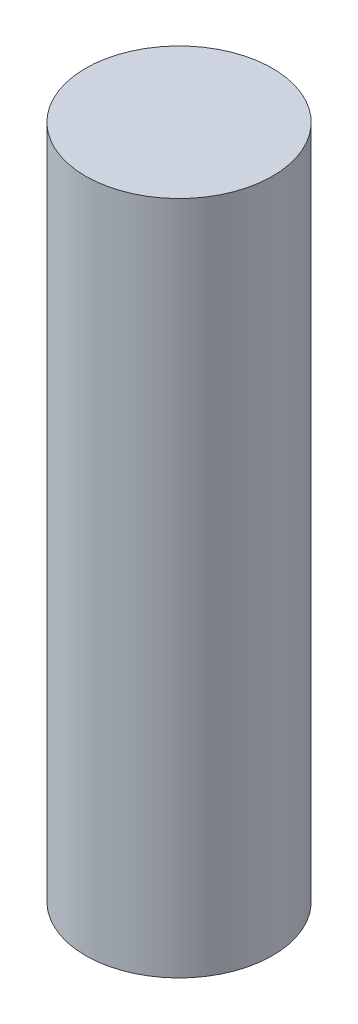
ISO-10303-21;
HEADER;
FILE_DESCRIPTION(('STEP AP214'),'2;1');
FILE_NAME('part.step','',(''),(''),'','','');
FILE_SCHEMA(('AUTOMOTIVE_DESIGN { 1 0 10303 214 1 1 1 1 }'));
ENDSEC;
DATA;
#1=APPLICATION_CONTEXT('core data for automotive mechanical design processes');
#2=APPLICATION_PROTOCOL_DEFINITION('international standard','automotive_design',2000,#1);
#3=PRODUCT_CONTEXT('',#1,'mechanical');
#4=PRODUCT('Part','Part','',(#3));
#5=PRODUCT_RELATED_PRODUCT_CATEGORY('part','',(#4));
#6=PRODUCT_DEFINITION_FORMATION('','',#4);
#7=PRODUCT_DEFINITION_CONTEXT('part definition',#1,'design');
#8=PRODUCT_DEFINITION('design','',#6,#7);
#9=PRODUCT_DEFINITION_SHAPE('','',#8);
#10=(LENGTH_UNIT() NAMED_UNIT(*) SI_UNIT(.MILLI.,.METRE.));
#11=(NAMED_UNIT(*) PLANE_ANGLE_UNIT() SI_UNIT($,.RADIAN.));
#12=(NAMED_UNIT(*) SI_UNIT($,.STERADIAN.) SOLID_ANGLE_UNIT());
#13=UNCERTAINTY_MEASURE_WITH_UNIT(LENGTH_MEASURE(1.E-05),#10,'distance_accuracy_value','');
#14=(GEOMETRIC_REPRESENTATION_CONTEXT(3) GLOBAL_UNCERTAINTY_ASSIGNED_CONTEXT((#13)) GLOBAL_UNIT_ASSIGNED_CONTEXT((#10,
#11,#12)) REPRESENTATION_CONTEXT('',''));
#15=CARTESIAN_POINT('',(0.,0.,0.));
#16=DIRECTION('',(0.,0.,1.));
#17=DIRECTION('',(1.,0.,0.));
#18=AXIS2_PLACEMENT_3D('',#15,#16,#17);
#19=CARTESIAN_POINT('',(0.,65.,0.));
#20=DIRECTION('',(0.,-1.,0.));
#21=DIRECTION('',(0.,0.,-1.));
#22=AXIS2_PLACEMENT_3D('',#19,#20,#21);
#23=CYLINDRICAL_SURFACE('',#22,9.);
#24=CARTESIAN_POINT('',(0.,65.,0.));
#25=DIRECTION('',(0.,1.,0.));
#26=DIRECTION('',(0.,0.,1.));
#27=AXIS2_PLACEMENT_3D('',#24,#25,#26);
#28=CIRCLE('',#27,9.);
#29=CARTESIAN_POINT('',(0.,65.,9.));
#30=VERTEX_POINT('',#29);
#31=EDGE_CURVE('E10',#30,#30,#28,.T.);
#32=ORIENTED_EDGE('',*,*,#31,.F.);
#33=EDGE_LOOP('',(#32));
#34=FACE_BOUND('',#33,.T.);
#35=CARTESIAN_POINT('',(0.,0.,0.));
#36=DIRECTION('',(0.,1.,0.));
#37=DIRECTION('',(0.,0.,1.));
#38=AXIS2_PLACEMENT_3D('',#35,#36,#37);
#39=CIRCLE('',#38,9.);
#40=CARTESIAN_POINT('',(0.,0.,9.));
#41=VERTEX_POINT('',#40);
#42=EDGE_CURVE('E46',#41,#41,#39,.T.);
#43=ORIENTED_EDGE('',*,*,#42,.T.);
#44=EDGE_LOOP('',(#43));
#45=FACE_BOUND('',#44,.T.);
#46=ADVANCED_FACE('F43',(#34,#45),#23,.T.);
#47=CARTESIAN_POINT('',(0.,65.,0.));
#48=DIRECTION('',(0.,1.,0.));
#49=DIRECTION('',(0.,0.,1.));
#50=AXIS2_PLACEMENT_3D('',#47,#48,#49);
#51=PLANE('',#50);
#52=ORIENTED_EDGE('',*,*,#31,.T.);
#53=EDGE_LOOP('',(#52));
#54=FACE_BOUND('',#53,.T.);
#55=ADVANCED_FACE('F60',(#54),#51,.T.);
#56=CARTESIAN_POINT('',(0.,0.,0.));
#57=DIRECTION('',(0.,1.,0.));
#58=DIRECTION('',(0.,0.,1.));
#59=AXIS2_PLACEMENT_3D('',#56,#57,#58);
#60=PLANE('',#59);
#61=ORIENTED_EDGE('',*,*,#42,.F.);
#62=EDGE_LOOP('',(#61));
#63=FACE_BOUND('',#62,.T.);
#64=ADVANCED_FACE('F58',(#63),#60,.F.);
#65=CLOSED_SHELL('',(#46,#55,#64));
#66=MANIFOLD_SOLID_BREP('B2',#65);
#67=ADVANCED_BREP_SHAPE_REPRESENTATION('',(#18,#66),#14);
#68=SHAPE_DEFINITION_REPRESENTATION(#9,#67);
ENDSEC;
END-ISO-10303-21;
